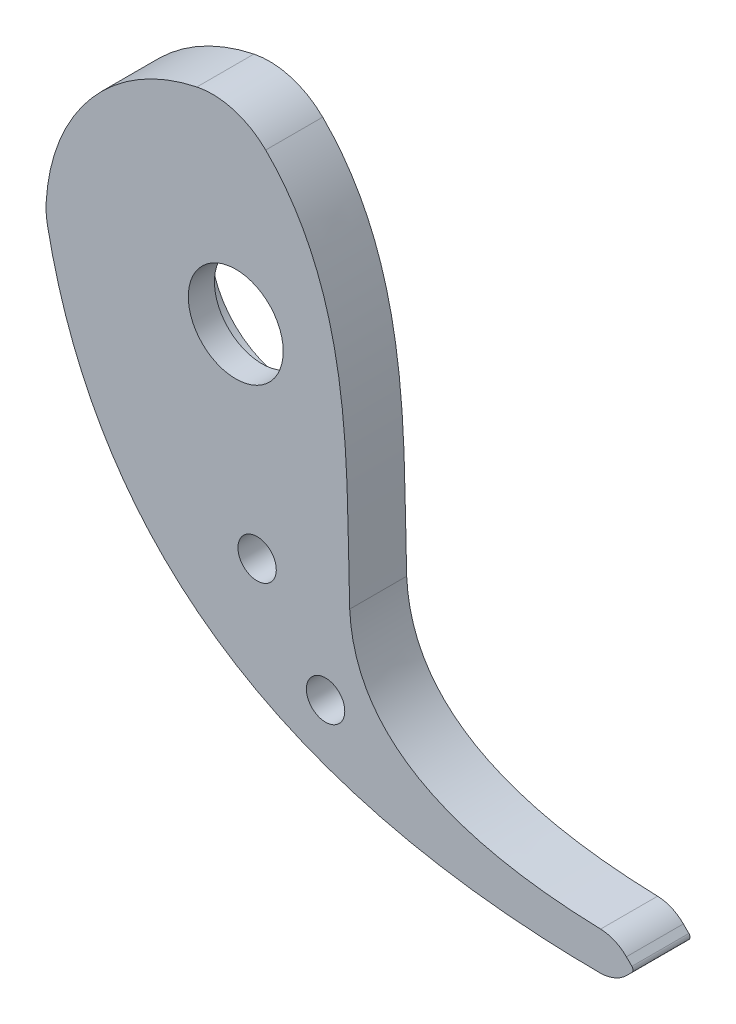
ISO-10303-21;
HEADER;
FILE_DESCRIPTION(('STEP AP214'),'2;1');
FILE_NAME('part.step','',(''),(''),'','','');
FILE_SCHEMA(('AUTOMOTIVE_DESIGN { 1 0 10303 214 1 1 1 1 }'));
ENDSEC;
DATA;
#1=APPLICATION_CONTEXT('core data for automotive mechanical design processes');
#2=APPLICATION_PROTOCOL_DEFINITION('international standard','automotive_design',2000,#1);
#3=PRODUCT_CONTEXT('',#1,'mechanical');
#4=PRODUCT('Part','Part','',(#3));
#5=PRODUCT_RELATED_PRODUCT_CATEGORY('part','',(#4));
#6=PRODUCT_DEFINITION_FORMATION('','',#4);
#7=PRODUCT_DEFINITION_CONTEXT('part definition',#1,'design');
#8=PRODUCT_DEFINITION('design','',#6,#7);
#9=PRODUCT_DEFINITION_SHAPE('','',#8);
#10=(LENGTH_UNIT() NAMED_UNIT(*) SI_UNIT(.MILLI.,.METRE.));
#11=(NAMED_UNIT(*) PLANE_ANGLE_UNIT() SI_UNIT($,.RADIAN.));
#12=(NAMED_UNIT(*) SI_UNIT($,.STERADIAN.) SOLID_ANGLE_UNIT());
#13=UNCERTAINTY_MEASURE_WITH_UNIT(LENGTH_MEASURE(1.E-05),#10,'distance_accuracy_value','');
#14=(GEOMETRIC_REPRESENTATION_CONTEXT(3) GLOBAL_UNCERTAINTY_ASSIGNED_CONTEXT((#13)) GLOBAL_UNIT_ASSIGNED_CONTEXT((#10,
#11,#12)) REPRESENTATION_CONTEXT('',''));
#15=CARTESIAN_POINT('',(0.,0.,0.));
#16=DIRECTION('',(0.,0.,1.));
#17=DIRECTION('',(1.,0.,0.));
#18=AXIS2_PLACEMENT_3D('',#15,#16,#17);
#19=CARTESIAN_POINT('',(0.,0.,84.));
#20=DIRECTION('',(0.,0.,1.));
#21=DIRECTION('',(1.,0.,0.));
#22=AXIS2_PLACEMENT_3D('',#19,#20,#21);
#23=CYLINDRICAL_SURFACE('',#22,12.5);
#24=CARTESIAN_POINT('',(0.,0.,93.12));
#25=DIRECTION('',(0.,0.,1.));
#26=DIRECTION('',(1.,0.,0.));
#27=AXIS2_PLACEMENT_3D('',#24,#25,#26);
#28=CIRCLE('',#27,12.5);
#29=CARTESIAN_POINT('',(12.5,0.,93.12));
#30=VERTEX_POINT('',#29);
#31=EDGE_CURVE('E38',#30,#30,#28,.F.);
#32=ORIENTED_EDGE('',*,*,#31,.T.);
#33=EDGE_LOOP('',(#32));
#34=FACE_BOUND('',#33,.T.);
#35=CARTESIAN_POINT('',(0.,0.,100.));
#36=DIRECTION('',(0.,0.,1.));
#37=DIRECTION('',(1.,0.,0.));
#38=AXIS2_PLACEMENT_3D('',#35,#36,#37);
#39=CIRCLE('',#38,12.5);
#40=CARTESIAN_POINT('',(12.5,0.,100.));
#41=VERTEX_POINT('',#40);
#42=EDGE_CURVE('E181',#41,#41,#39,.T.);
#43=ORIENTED_EDGE('',*,*,#42,.T.);
#44=EDGE_LOOP('',(#43));
#45=FACE_BOUND('',#44,.T.);
#46=ADVANCED_FACE('F33',(#34,#45),#23,.F.);
#47=CARTESIAN_POINT('',(96.0614321255408,-89.9222344491999,100.));
#48=CARTESIAN_POINT('',(74.6396324890567,-89.3105921557209,100.));
#49=CARTESIAN_POINT('',(42.207594165123,-82.0452441207387,100.));
#50=CARTESIAN_POINT('',(30.5986777387312,-62.6957691895991,100.));
#51=CARTESIAN_POINT('',(30.,-50.,100.));
#52=B_SPLINE_CURVE_WITH_KNOTS('',3,(#47,#48,#49,#50,#51),.UNSPECIFIED.,.F.,.F.,(4,1,4),
(0.0277647284146162,0.487449893921152,0.947135059427687),.UNSPECIFIED.);
#53=DIRECTION('',(0.,0.,-1.));
#54=VECTOR('',#53,1.);
#55=SURFACE_OF_LINEAR_EXTRUSION('',#52,#54);
#56=DIRECTION('',(0.,0.,-1.));
#57=VECTOR('',#56,1.);
#58=CARTESIAN_POINT('',(96.0614321255408,-89.9222344491999,100.));
#59=LINE('',#58,#57);
#60=CARTESIAN_POINT('',(96.0614321255408,-89.9222344491999,100.));
#61=VERTEX_POINT('',#60);
#62=CARTESIAN_POINT('',(96.0614321255408,-89.9222344491999,85.));
#63=VERTEX_POINT('',#62);
#64=EDGE_CURVE('E138',#61,#63,#59,.T.);
#65=ORIENTED_EDGE('',*,*,#64,.T.);
#66=CARTESIAN_POINT('',(96.0614321255408,-89.9222344491999,85.));
#67=CARTESIAN_POINT('',(74.6396324890567,-89.3105921557209,85.));
#68=CARTESIAN_POINT('',(42.207594165123,-82.0452441207387,85.));
#69=CARTESIAN_POINT('',(30.5986777387312,-62.6957691895991,85.));
#70=CARTESIAN_POINT('',(30.,-50.,85.));
#71=B_SPLINE_CURVE_WITH_KNOTS('',3,(#66,#67,#68,#69,#70),.UNSPECIFIED.,.F.,.F.,(4,1,4),
(0.0277647284146162,0.487449893921152,0.947135059427687),.UNSPECIFIED.);
#72=CARTESIAN_POINT('',(30.,-50.,85.));
#73=VERTEX_POINT('',#72);
#74=EDGE_CURVE('E51',#63,#73,#71,.T.);
#75=ORIENTED_EDGE('',*,*,#74,.T.);
#76=DIRECTION('',(0.,0.,-1.));
#77=VECTOR('',#76,1.);
#78=CARTESIAN_POINT('',(30.,-50.,100.));
#79=LINE('',#78,#77);
#80=CARTESIAN_POINT('',(30.,-50.,100.));
#81=VERTEX_POINT('',#80);
#82=EDGE_CURVE('E11',#81,#73,#79,.T.);
#83=ORIENTED_EDGE('',*,*,#82,.F.);
#84=EDGE_CURVE('E234',#61,#81,#52,.T.);
#85=ORIENTED_EDGE('',*,*,#84,.F.);
#86=EDGE_LOOP('',(#65,#75,#83,#85));
#87=FACE_BOUND('',#86,.T.);
#88=ADVANCED_FACE('F35',(#87),#55,.F.);
#89=CARTESIAN_POINT('',(30.,-50.,100.));
#90=CARTESIAN_POINT('',(29.0655778584205,-23.9165926404982,100.));
#91=CARTESIAN_POINT('',(31.4518831291268,15.3536689120195,100.));
#92=CARTESIAN_POINT('',(10.553539900454,41.0011969030345,100.));
#93=CARTESIAN_POINT('',(7.88775097032687,43.6234763854406,100.));
#94=B_SPLINE_CURVE_WITH_KNOTS('',3,(#89,#90,#91,#92,#93),.UNSPECIFIED.,.F.,.F.,(4,1,4),(0.,
0.805376888640356,0.908560602925233),.UNSPECIFIED.);
#95=DIRECTION('',(0.,0.,-1.));
#96=VECTOR('',#95,1.);
#97=SURFACE_OF_LINEAR_EXTRUSION('',#94,#96);
#98=ORIENTED_EDGE('',*,*,#82,.T.);
#99=CARTESIAN_POINT('',(30.,-50.,85.));
#100=CARTESIAN_POINT('',(29.0655778584205,-23.9165926404982,85.));
#101=CARTESIAN_POINT('',(31.4518831291268,15.3536689120195,85.));
#102=CARTESIAN_POINT('',(10.553539900454,41.0011969030345,85.));
#103=CARTESIAN_POINT('',(7.88775097032687,43.6234763854406,85.));
#104=B_SPLINE_CURVE_WITH_KNOTS('',3,(#99,#100,#101,#102,#103),.UNSPECIFIED.,.F.,.F.,(4,1,4),(0.,
0.805376888640356,0.908560602925233),.UNSPECIFIED.);
#105=CARTESIAN_POINT('',(7.88775097032688,43.6234763854406,85.));
#106=VERTEX_POINT('',#105);
#107=EDGE_CURVE('E224',#73,#106,#104,.T.);
#108=ORIENTED_EDGE('',*,*,#107,.T.);
#109=DIRECTION('',(0.,0.,-1.));
#110=VECTOR('',#109,1.);
#111=CARTESIAN_POINT('',(7.88775097032687,43.6234763854406,100.));
#112=LINE('',#111,#110);
#113=CARTESIAN_POINT('',(7.88775097032687,43.6234763854406,100.));
#114=VERTEX_POINT('',#113);
#115=EDGE_CURVE('E43',#114,#106,#112,.T.);
#116=ORIENTED_EDGE('',*,*,#115,.F.);
#117=EDGE_CURVE('E242',#81,#114,#94,.T.);
#118=ORIENTED_EDGE('',*,*,#117,.F.);
#119=EDGE_LOOP('',(#98,#108,#116,#118));
#120=FACE_BOUND('',#119,.T.);
#121=ADVANCED_FACE('F255',(#120),#97,.F.);
#122=CARTESIAN_POINT('',(-6.13755051397834,29.3654639617419,100.));
#123=DIRECTION('',(0.,0.,-1.));
#124=DIRECTION('',(-1.,0.,0.));
#125=AXIS2_PLACEMENT_3D('',#122,#123,#124);
#126=CYLINDRICAL_SURFACE('',#125,20.);
#127=ORIENTED_EDGE('',*,*,#115,.T.);
#128=CARTESIAN_POINT('',(-6.13755051397834,29.3654639617419,85.));
#129=DIRECTION('',(0.,0.,1.));
#130=DIRECTION('',(1.,0.,0.));
#131=AXIS2_PLACEMENT_3D('',#128,#129,#130);
#132=CIRCLE('',#131,20.);
#133=CARTESIAN_POINT('',(-10.2292508566306,48.9424399362366,85.));
#134=VERTEX_POINT('',#133);
#135=EDGE_CURVE('E221',#106,#134,#132,.T.);
#136=ORIENTED_EDGE('',*,*,#135,.T.);
#137=DIRECTION('',(0.,0.,-1.));
#138=VECTOR('',#137,1.);
#139=CARTESIAN_POINT('',(-10.2292508566306,48.9424399362366,100.));
#140=LINE('',#139,#138);
#141=CARTESIAN_POINT('',(-10.2292508566306,48.9424399362366,100.));
#142=VERTEX_POINT('',#141);
#143=EDGE_CURVE('E159',#142,#134,#140,.T.);
#144=ORIENTED_EDGE('',*,*,#143,.F.);
#145=CARTESIAN_POINT('',(-6.13755051397834,29.3654639617419,100.));
#146=DIRECTION('',(0.,0.,1.));
#147=DIRECTION('',(1.,0.,0.));
#148=AXIS2_PLACEMENT_3D('',#145,#146,#147);
#149=CIRCLE('',#148,20.);
#150=EDGE_CURVE('E250',#114,#142,#149,.T.);
#151=ORIENTED_EDGE('',*,*,#150,.F.);
#152=EDGE_LOOP('',(#127,#136,#144,#151));
#153=FACE_BOUND('',#152,.T.);
#154=ADVANCED_FACE('F258',(#153),#126,.T.);
#155=CARTESIAN_POINT('',(0.,0.,100.));
#156=DIRECTION('',(0.,0.,-1.));
#157=DIRECTION('',(-1.,0.,0.));
#158=AXIS2_PLACEMENT_3D('',#155,#156,#157);
#159=CYLINDRICAL_SURFACE('',#158,50.);
#160=ORIENTED_EDGE('',*,*,#143,.T.);
#161=CARTESIAN_POINT('',(0.,0.,85.));
#162=DIRECTION('',(0.,0.,1.));
#163=DIRECTION('',(1.,0.,0.));
#164=AXIS2_PLACEMENT_3D('',#161,#162,#163);
#165=CIRCLE('',#164,50.);
#166=CARTESIAN_POINT('',(-49.9267220496655,2.70599803685169,85.));
#167=VERTEX_POINT('',#166);
#168=EDGE_CURVE('E218',#134,#167,#165,.T.);
#169=ORIENTED_EDGE('',*,*,#168,.T.);
#170=DIRECTION('',(0.,0.,-1.));
#171=VECTOR('',#170,1.);
#172=CARTESIAN_POINT('',(-49.9267220496655,2.70599803685169,100.));
#173=LINE('',#172,#171);
#174=CARTESIAN_POINT('',(-49.9267220496655,2.70599803685169,100.));
#175=VERTEX_POINT('',#174);
#176=EDGE_CURVE('E156',#175,#167,#173,.T.);
#177=ORIENTED_EDGE('',*,*,#176,.F.);
#178=CARTESIAN_POINT('',(0.,0.,100.));
#179=DIRECTION('',(0.,0.,1.));
#180=DIRECTION('',(1.,0.,0.));
#181=AXIS2_PLACEMENT_3D('',#178,#179,#180);
#182=CIRCLE('',#181,50.);
#183=EDGE_CURVE('E314',#142,#175,#182,.T.);
#184=ORIENTED_EDGE('',*,*,#183,.F.);
#185=EDGE_LOOP('',(#160,#169,#177,#184));
#186=FACE_BOUND('',#185,.T.);
#187=ADVANCED_FACE('F262',(#186),#159,.T.);
#188=CARTESIAN_POINT('',(-29.9560332297993,1.62359882211103,100.));
#189=DIRECTION('',(0.,0.,-1.));
#190=DIRECTION('',(-1.,0.,0.));
#191=AXIS2_PLACEMENT_3D('',#188,#189,#190);
#192=CYLINDRICAL_SURFACE('',#191,20.);
#193=ORIENTED_EDGE('',*,*,#176,.T.);
#194=CARTESIAN_POINT('',(-29.9560332297993,1.62359882211103,85.));
#195=DIRECTION('',(0.,0.,1.));
#196=DIRECTION('',(1.,0.,0.));
#197=AXIS2_PLACEMENT_3D('',#194,#195,#196);
#198=CIRCLE('',#197,20.);
#199=CARTESIAN_POINT('',(-49.5860072797543,-2.20577694922467,85.));
#200=VERTEX_POINT('',#199);
#201=EDGE_CURVE('E212',#167,#200,#198,.T.);
#202=ORIENTED_EDGE('',*,*,#201,.T.);
#203=DIRECTION('',(0.,0.,-1.));
#204=VECTOR('',#203,1.);
#205=CARTESIAN_POINT('',(-49.5860072797543,-2.20577694922468,100.));
#206=LINE('',#205,#204);
#207=CARTESIAN_POINT('',(-49.5860072797543,-2.20577694922468,100.));
#208=VERTEX_POINT('',#207);
#209=EDGE_CURVE('E153',#208,#200,#206,.T.);
#210=ORIENTED_EDGE('',*,*,#209,.F.);
#211=CARTESIAN_POINT('',(-29.9560332297993,1.62359882211103,100.));
#212=DIRECTION('',(0.,0.,1.));
#213=DIRECTION('',(-1.,0.,0.));
#214=AXIS2_PLACEMENT_3D('',#211,#212,#213);
#215=CIRCLE('',#214,20.);
#216=EDGE_CURVE('E285',#175,#208,#215,.T.);
#217=ORIENTED_EDGE('',*,*,#216,.F.);
#218=EDGE_LOOP('',(#193,#202,#210,#217));
#219=FACE_BOUND('',#218,.T.);
#220=ADVANCED_FACE('F266',(#219),#192,.T.);
#221=CARTESIAN_POINT('',(-49.5860072797543,-2.20577694922467,100.));
#222=CARTESIAN_POINT('',(-47.0447095065424,-15.2328634302042,100.));
#223=CARTESIAN_POINT('',(-27.0452536153668,-73.5633104074933,100.));
#224=CARTESIAN_POINT('',(28.6366700505365,-99.6569197690937,100.));
#225=CARTESIAN_POINT('',(95.8012423090635,-100.004707302185,100.));
#226=B_SPLINE_CURVE_WITH_KNOTS('',3,(#221,#222,#223,#224,#225),.UNSPECIFIED.,.F.,.F.,(4,1,4),
(0.0110398117893649,0.207725041354784,0.983937689400536),.UNSPECIFIED.);
#227=DIRECTION('',(0.,0.,-1.));
#228=VECTOR('',#227,1.);
#229=SURFACE_OF_LINEAR_EXTRUSION('',#226,#228);
#230=ORIENTED_EDGE('',*,*,#209,.T.);
#231=CARTESIAN_POINT('',(-49.5860072797543,-2.20577694922467,85.));
#232=CARTESIAN_POINT('',(-47.0447095065424,-15.2328634302042,85.));
#233=CARTESIAN_POINT('',(-27.0452536153668,-73.5633104074933,85.));
#234=CARTESIAN_POINT('',(28.6366700505365,-99.6569197690937,85.));
#235=CARTESIAN_POINT('',(95.8012423090635,-100.004707302185,85.));
#236=B_SPLINE_CURVE_WITH_KNOTS('',3,(#231,#232,#233,#234,#235),.UNSPECIFIED.,.F.,.F.,(4,1,4),
(0.0110398117893649,0.207725041354784,0.983937689400536),.UNSPECIFIED.);
#237=CARTESIAN_POINT('',(95.8012423090635,-100.004707302185,85.));
#238=VERTEX_POINT('',#237);
#239=EDGE_CURVE('E207',#200,#238,#236,.T.);
#240=ORIENTED_EDGE('',*,*,#239,.T.);
#241=DIRECTION('',(0.,0.,-1.));
#242=VECTOR('',#241,1.);
#243=CARTESIAN_POINT('',(95.8012423090635,-100.004707302185,100.));
#244=LINE('',#243,#242);
#245=CARTESIAN_POINT('',(95.8012423090635,-100.004707302185,100.));
#246=VERTEX_POINT('',#245);
#247=EDGE_CURVE('E150',#246,#238,#244,.T.);
#248=ORIENTED_EDGE('',*,*,#247,.F.);
#249=EDGE_CURVE('E278',#208,#246,#226,.T.);
#250=ORIENTED_EDGE('',*,*,#249,.F.);
#251=EDGE_LOOP('',(#230,#240,#248,#250));
#252=FACE_BOUND('',#251,.T.);
#253=ADVANCED_FACE('F270',(#252),#229,.F.);
#254=CARTESIAN_POINT('',(95.8530230111228,-90.0048413651389,100.));
#255=DIRECTION('',(0.,0.,-1.));
#256=DIRECTION('',(-1.,0.,0.));
#257=AXIS2_PLACEMENT_3D('',#254,#255,#256);
#258=CYLINDRICAL_SURFACE('',#257,10.);
#259=ORIENTED_EDGE('',*,*,#247,.T.);
#260=CARTESIAN_POINT('',(95.8530230111228,-90.0048413651389,85.));
#261=DIRECTION('',(0.,0.,1.));
#262=DIRECTION('',(1.,0.,0.));
#263=AXIS2_PLACEMENT_3D('',#260,#261,#262);
#264=CIRCLE('',#263,10.);
#265=CARTESIAN_POINT('',(102.924090822988,-97.0759091770044,85.));
#266=VERTEX_POINT('',#265);
#267=EDGE_CURVE('E204',#238,#266,#264,.T.);
#268=ORIENTED_EDGE('',*,*,#267,.T.);
#269=DIRECTION('',(0.,0.,-1.));
#270=VECTOR('',#269,1.);
#271=CARTESIAN_POINT('',(102.924090822988,-97.0759091770044,100.));
#272=LINE('',#271,#270);
#273=CARTESIAN_POINT('',(102.924090822988,-97.0759091770044,100.));
#274=VERTEX_POINT('',#273);
#275=EDGE_CURVE('E147',#274,#266,#272,.T.);
#276=ORIENTED_EDGE('',*,*,#275,.F.);
#277=CARTESIAN_POINT('',(95.8530230111228,-90.0048413651389,100.));
#278=DIRECTION('',(0.,0.,1.));
#279=DIRECTION('',(-1.,0.,0.));
#280=AXIS2_PLACEMENT_3D('',#277,#278,#279);
#281=CIRCLE('',#280,10.);
#282=EDGE_CURVE('E284',#246,#274,#281,.T.);
#283=ORIENTED_EDGE('',*,*,#282,.F.);
#284=EDGE_LOOP('',(#259,#268,#276,#283));
#285=FACE_BOUND('',#284,.T.);
#286=ADVANCED_FACE('F275',(#285),#258,.T.);
#287=CARTESIAN_POINT('',(102.924090822988,-97.0759091770044,100.));
#288=DIRECTION('',(-0.707106781186551,0.707106781186544,0.));
#289=DIRECTION('',(-0.707106781186544,-0.707106781186551,0.));
#290=AXIS2_PLACEMENT_3D('',#287,#288,#289);
#291=PLANE('',#290);
#292=ORIENTED_EDGE('',*,*,#275,.T.);
#293=DIRECTION('',(0.707106781186544,0.707106781186551,0.));
#294=VECTOR('',#293,1.);
#295=CARTESIAN_POINT('',(102.924090822988,-97.0759091770044,85.));
#296=LINE('',#295,#294);
#297=CARTESIAN_POINT('',(104.29289321881,-95.7071067811829,85.));
#298=VERTEX_POINT('',#297);
#299=EDGE_CURVE('E201',#266,#298,#296,.T.);
#300=ORIENTED_EDGE('',*,*,#299,.T.);
#301=DIRECTION('',(0.,0.,-1.));
#302=VECTOR('',#301,1.);
#303=CARTESIAN_POINT('',(104.29289321881,-95.7071067811829,100.));
#304=LINE('',#303,#302);
#305=CARTESIAN_POINT('',(104.29289321881,-95.7071067811829,100.));
#306=VERTEX_POINT('',#305);
#307=EDGE_CURVE('E140',#306,#298,#304,.T.);
#308=ORIENTED_EDGE('',*,*,#307,.F.);
#309=DIRECTION('',(0.707106781186544,0.707106781186551,0.));
#310=VECTOR('',#309,1.);
#311=CARTESIAN_POINT('',(102.924090822988,-97.0759091770044,100.));
#312=LINE('',#311,#310);
#313=EDGE_CURVE('E290',#274,#306,#312,.T.);
#314=ORIENTED_EDGE('',*,*,#313,.F.);
#315=EDGE_LOOP('',(#292,#300,#308,#314));
#316=FACE_BOUND('',#315,.T.);
#317=ADVANCED_FACE('F303',(#316),#291,.F.);
#318=CARTESIAN_POINT('',(103.585786437623,-94.9999999999963,100.));
#319=DIRECTION('',(0.,0.,-1.));
#320=DIRECTION('',(-1.,0.,0.));
#321=AXIS2_PLACEMENT_3D('',#318,#319,#320);
#322=CYLINDRICAL_SURFACE('',#321,0.999999999999997);
#323=ORIENTED_EDGE('',*,*,#307,.T.);
#324=CARTESIAN_POINT('',(103.585786437623,-94.9999999999963,85.));
#325=DIRECTION('',(0.,0.,1.));
#326=DIRECTION('',(1.,0.,0.));
#327=AXIS2_PLACEMENT_3D('',#324,#325,#326);
#328=CIRCLE('',#327,0.999999999999997);
#329=CARTESIAN_POINT('',(104.29289321881,-94.2928932188098,85.));
#330=VERTEX_POINT('',#329);
#331=EDGE_CURVE('E135',#298,#330,#328,.T.);
#332=ORIENTED_EDGE('',*,*,#331,.T.);
#333=DIRECTION('',(0.,0.,-1.));
#334=VECTOR('',#333,1.);
#335=CARTESIAN_POINT('',(104.29289321881,-94.2928932188098,100.));
#336=LINE('',#335,#334);
#337=CARTESIAN_POINT('',(104.29289321881,-94.2928932188098,100.));
#338=VERTEX_POINT('',#337);
#339=EDGE_CURVE('E134',#338,#330,#336,.T.);
#340=ORIENTED_EDGE('',*,*,#339,.F.);
#341=CARTESIAN_POINT('',(103.585786437623,-94.9999999999963,100.));
#342=DIRECTION('',(0.,0.,1.));
#343=DIRECTION('',(-1.,0.,0.));
#344=AXIS2_PLACEMENT_3D('',#341,#342,#343);
#345=CIRCLE('',#344,0.999999999999997);
#346=EDGE_CURVE('E292',#306,#338,#345,.T.);
#347=ORIENTED_EDGE('',*,*,#346,.F.);
#348=EDGE_LOOP('',(#323,#332,#340,#347));
#349=FACE_BOUND('',#348,.T.);
#350=ADVANCED_FACE('F301',(#349),#322,.T.);
#351=CARTESIAN_POINT('',(102.84709295017,-92.8470929501699,100.));
#352=DIRECTION('',(-0.707106781186548,-0.707106781186548,0.));
#353=DIRECTION('',(0.707106781186548,-0.707106781186548,0.));
#354=AXIS2_PLACEMENT_3D('',#351,#352,#353);
#355=PLANE('',#354);
#356=ORIENTED_EDGE('',*,*,#339,.T.);
#357=DIRECTION('',(-0.707106781186548,0.707106781186548,0.));
#358=VECTOR('',#357,1.);
#359=CARTESIAN_POINT('',(102.84709295017,-92.8470929501699,85.));
#360=LINE('',#359,#358);
#361=CARTESIAN_POINT('',(102.84709295017,-92.8470929501699,85.));
#362=VERTEX_POINT('',#361);
#363=EDGE_CURVE('E120',#330,#362,#360,.T.);
#364=ORIENTED_EDGE('',*,*,#363,.T.);
#365=DIRECTION('',(0.,0.,-1.));
#366=VECTOR('',#365,1.);
#367=CARTESIAN_POINT('',(102.84709295017,-92.8470929501699,100.));
#368=LINE('',#367,#366);
#369=CARTESIAN_POINT('',(102.84709295017,-92.8470929501699,100.));
#370=VERTEX_POINT('',#369);
#371=EDGE_CURVE('E132',#370,#362,#368,.T.);
#372=ORIENTED_EDGE('',*,*,#371,.F.);
#373=DIRECTION('',(-0.707106781186548,0.707106781186548,0.));
#374=VECTOR('',#373,1.);
#375=CARTESIAN_POINT('',(102.84709295017,-92.8470929501699,100.));
#376=LINE('',#375,#374);
#377=EDGE_CURVE('E294',#338,#370,#376,.T.);
#378=ORIENTED_EDGE('',*,*,#377,.F.);
#379=EDGE_LOOP('',(#356,#364,#372,#378));
#380=FACE_BOUND('',#379,.T.);
#381=ADVANCED_FACE('F130',(#380),#355,.F.);
#382=CARTESIAN_POINT('',(95.7760251383045,-99.9181607620354,100.));
#383=DIRECTION('',(0.,0.,-1.));
#384=DIRECTION('',(-1.,0.,0.));
#385=AXIS2_PLACEMENT_3D('',#382,#383,#384);
#386=CYLINDRICAL_SURFACE('',#385,10.);
#387=ORIENTED_EDGE('',*,*,#371,.T.);
#388=CARTESIAN_POINT('',(95.7760251383045,-99.9181607620354,85.));
#389=DIRECTION('',(0.,0.,1.));
#390=DIRECTION('',(1.,0.,0.));
#391=AXIS2_PLACEMENT_3D('',#388,#389,#390);
#392=CIRCLE('',#391,10.);
#393=EDGE_CURVE('E117',#362,#63,#392,.T.);
#394=ORIENTED_EDGE('',*,*,#393,.T.);
#395=ORIENTED_EDGE('',*,*,#64,.F.);
#396=CARTESIAN_POINT('',(95.7760251383045,-99.9181607620354,100.));
#397=DIRECTION('',(0.,0.,1.));
#398=DIRECTION('',(1.,0.,0.));
#399=AXIS2_PLACEMENT_3D('',#396,#397,#398);
#400=CIRCLE('',#399,10.);
#401=EDGE_CURVE('E59',#370,#61,#400,.T.);
#402=ORIENTED_EDGE('',*,*,#401,.F.);
#403=EDGE_LOOP('',(#387,#394,#395,#402));
#404=FACE_BOUND('',#403,.T.);
#405=ADVANCED_FACE('F137',(#404),#386,.T.);
#406=CARTESIAN_POINT('',(47.4133746395084,-79.0242123966994,100.));
#407=DIRECTION('',(0.,0.,1.));
#408=DIRECTION('',(1.,0.,0.));
#409=AXIS2_PLACEMENT_3D('',#406,#407,#408);
#410=PLANE('',#409);
#411=CARTESIAN_POINT('',(23.6513180824392,-73.9138117802537,100.));
#412=DIRECTION('',(0.,0.,1.));
#413=DIRECTION('',(1.,0.,0.));
#414=AXIS2_PLACEMENT_3D('',#411,#412,#413);
#415=CIRCLE('',#414,5.05);
#416=CARTESIAN_POINT('',(28.7013180824392,-73.9138117802537,100.));
#417=VERTEX_POINT('',#416);
#418=EDGE_CURVE('E125',#417,#417,#415,.F.);
#419=ORIENTED_EDGE('',*,*,#418,.T.);
#420=EDGE_LOOP('',(#419));
#421=FACE_BOUND('',#420,.T.);
#422=CARTESIAN_POINT('',(5.62196341020624,-50.7014980743151,100.));
#423=DIRECTION('',(0.,0.,1.));
#424=DIRECTION('',(1.,0.,0.));
#425=AXIS2_PLACEMENT_3D('',#422,#423,#424);
#426=CIRCLE('',#425,5.05);
#427=CARTESIAN_POINT('',(10.6666689251155,-50.932682563078,100.));
#428=VERTEX_POINT('',#427);
#429=EDGE_CURVE('E171',#428,#428,#426,.F.);
#430=ORIENTED_EDGE('',*,*,#429,.T.);
#431=EDGE_LOOP('',(#430));
#432=FACE_BOUND('',#431,.T.);
#433=ORIENTED_EDGE('',*,*,#84,.T.);
#434=ORIENTED_EDGE('',*,*,#117,.T.);
#435=ORIENTED_EDGE('',*,*,#150,.T.);
#436=ORIENTED_EDGE('',*,*,#183,.T.);
#437=ORIENTED_EDGE('',*,*,#216,.T.);
#438=ORIENTED_EDGE('',*,*,#249,.T.);
#439=ORIENTED_EDGE('',*,*,#282,.T.);
#440=ORIENTED_EDGE('',*,*,#313,.T.);
#441=ORIENTED_EDGE('',*,*,#346,.T.);
#442=ORIENTED_EDGE('',*,*,#377,.T.);
#443=ORIENTED_EDGE('',*,*,#401,.T.);
#444=EDGE_LOOP('',(#433,#434,#435,#436,#437,#438,#439,#440,#441,#442,#443));
#445=FACE_BOUND('',#444,.T.);
#446=ORIENTED_EDGE('',*,*,#42,.F.);
#447=EDGE_LOOP('',(#446));
#448=FACE_BOUND('',#447,.T.);
#449=ADVANCED_FACE('F295',(#421,#432,#445,#448),#410,.T.);
#450=CARTESIAN_POINT('',(0.,0.,85.));
#451=DIRECTION('',(0.,0.,1.));
#452=DIRECTION('',(1.,0.,0.));
#453=AXIS2_PLACEMENT_3D('',#450,#451,#452);
#454=PLANE('',#453);
#455=CARTESIAN_POINT('',(0.,0.,85.));
#456=DIRECTION('',(0.,0.,1.));
#457=DIRECTION('',(1.,0.,0.));
#458=AXIS2_PLACEMENT_3D('',#455,#456,#457);
#459=CIRCLE('',#458,21.63);
#460=CARTESIAN_POINT('',(21.63,0.,85.));
#461=VERTEX_POINT('',#460);
#462=EDGE_CURVE('E175',#461,#461,#459,.F.);
#463=ORIENTED_EDGE('',*,*,#462,.F.);
#464=EDGE_LOOP('',(#463));
#465=FACE_BOUND('',#464,.T.);
#466=CARTESIAN_POINT('',(23.6513180824392,-73.9138117802537,85.));
#467=DIRECTION('',(0.,0.,1.));
#468=DIRECTION('',(1.,0.,0.));
#469=AXIS2_PLACEMENT_3D('',#466,#467,#468);
#470=CIRCLE('',#469,3.03);
#471=CARTESIAN_POINT('',(26.6813180824392,-73.9138117802537,85.));
#472=VERTEX_POINT('',#471);
#473=EDGE_CURVE('E167',#472,#472,#470,.F.);
#474=ORIENTED_EDGE('',*,*,#473,.F.);
#475=EDGE_LOOP('',(#474));
#476=FACE_BOUND('',#475,.T.);
#477=CARTESIAN_POINT('',(5.62196341020624,-50.7014980743151,85.));
#478=DIRECTION('',(0.,0.,1.));
#479=DIRECTION('',(1.,0.,0.));
#480=AXIS2_PLACEMENT_3D('',#477,#478,#479);
#481=CIRCLE('',#480,3.03);
#482=CARTESIAN_POINT('',(8.64878671915177,-50.8402087675728,85.));
#483=VERTEX_POINT('',#482);
#484=EDGE_CURVE('E164',#483,#483,#481,.F.);
#485=ORIENTED_EDGE('',*,*,#484,.F.);
#486=EDGE_LOOP('',(#485));
#487=FACE_BOUND('',#486,.T.);
#488=ORIENTED_EDGE('',*,*,#393,.F.);
#489=ORIENTED_EDGE('',*,*,#363,.F.);
#490=ORIENTED_EDGE('',*,*,#331,.F.);
#491=ORIENTED_EDGE('',*,*,#299,.F.);
#492=ORIENTED_EDGE('',*,*,#267,.F.);
#493=ORIENTED_EDGE('',*,*,#239,.F.);
#494=ORIENTED_EDGE('',*,*,#201,.F.);
#495=ORIENTED_EDGE('',*,*,#168,.F.);
#496=ORIENTED_EDGE('',*,*,#135,.F.);
#497=ORIENTED_EDGE('',*,*,#107,.F.);
#498=ORIENTED_EDGE('',*,*,#74,.F.);
#499=EDGE_LOOP('',(#488,#489,#490,#491,#492,#493,#494,#495,#496,#497,#498));
#500=FACE_BOUND('',#499,.T.);
#501=ADVANCED_FACE('F119',(#465,#476,#487,#500),#454,.F.);
#502=CARTESIAN_POINT('',(5.62196341020624,-50.7014980743151,14.6340844617728));
#503=DIRECTION('',(0.,0.,1.));
#504=DIRECTION('',(0.998951587110736,-0.04577910668572,0.));
#505=AXIS2_PLACEMENT_3D('',#502,#503,#504);
#506=CYLINDRICAL_SURFACE('',#505,3.03);
#507=CARTESIAN_POINT('',(5.62196341020624,-50.7014980743151,90.3840844617728));
#508=DIRECTION('',(0.,0.,-1.));
#509=DIRECTION('',(-0.998951587110736,0.04577910668572,0.));
#510=AXIS2_PLACEMENT_3D('',#507,#508,#509);
#511=CIRCLE('',#510,3.03);
#512=CARTESIAN_POINT('',(8.64878671915177,-50.8402087675728,90.3840844617727));
#513=VERTEX_POINT('',#512);
#514=EDGE_CURVE('E195',#513,#513,#511,.T.);
#515=CARTESIAN_POINT('',(8.64878671915177,-50.8402087675728,90.3840844617727));
#516=CARTESIAN_POINT('',(8.64878671915177,-50.8402087675728,90.3280002486293));
#517=CARTESIAN_POINT('',(8.64878671915177,-50.8402087675728,90.2719160354858));
#518=CARTESIAN_POINT('',(8.64878671915177,-50.8402087675728,90.1597476091989));
#519=CARTESIAN_POINT('',(8.64878671915177,-50.8402087675728,90.1036633960554));
#520=CARTESIAN_POINT('',(8.64878671915177,-50.8402087675728,89.9914949697685));
#521=CARTESIAN_POINT('',(8.64878671915177,-50.8402087675728,89.935410756625));
#522=CARTESIAN_POINT('',(8.64878671915177,-50.8402087675728,89.8232423303381));
#523=CARTESIAN_POINT('',(8.64878671915177,-50.8402087675728,89.7671581171946));
#524=CARTESIAN_POINT('',(8.64878671915177,-50.8402087675728,89.6549896909077));
#525=CARTESIAN_POINT('',(8.64878671915177,-50.8402087675728,89.5989054777642));
#526=CARTESIAN_POINT('',(8.64878671915177,-50.8402087675728,89.4867370514773));
#527=CARTESIAN_POINT('',(8.64878671915177,-50.8402087675728,89.4306528383338));
#528=CARTESIAN_POINT('',(8.64878671915177,-50.8402087675728,89.3184844120469));
#529=CARTESIAN_POINT('',(8.64878671915177,-50.8402087675728,89.2624001989034));
#530=CARTESIAN_POINT('',(8.64878671915177,-50.8402087675728,89.1502317726165));
#531=CARTESIAN_POINT('',(8.64878671915177,-50.8402087675728,89.094147559473));
#532=CARTESIAN_POINT('',(8.64878671915177,-50.8402087675728,88.9819791331861));
#533=CARTESIAN_POINT('',(8.64878671915177,-50.8402087675728,88.9258949200426));
#534=CARTESIAN_POINT('',(8.64878671915177,-50.8402087675728,88.8137264937557));
#535=CARTESIAN_POINT('',(8.64878671915177,-50.8402087675728,88.7576422806122));
#536=CARTESIAN_POINT('',(8.64878671915177,-50.8402087675728,88.6454738543253));
#537=CARTESIAN_POINT('',(8.64878671915177,-50.8402087675728,88.5893896411818));
#538=CARTESIAN_POINT('',(8.64878671915177,-50.8402087675728,88.4772212148949));
#539=CARTESIAN_POINT('',(8.64878671915177,-50.8402087675728,88.4211370017514));
#540=CARTESIAN_POINT('',(8.64878671915177,-50.8402087675728,88.3089685754645));
#541=CARTESIAN_POINT('',(8.64878671915177,-50.8402087675728,88.252884362321));
#542=CARTESIAN_POINT('',(8.64878671915177,-50.8402087675728,88.1407159360341));
#543=CARTESIAN_POINT('',(8.64878671915177,-50.8402087675728,88.0846317228906));
#544=CARTESIAN_POINT('',(8.64878671915177,-50.8402087675728,87.9724632966037));
#545=CARTESIAN_POINT('',(8.64878671915177,-50.8402087675728,87.9163790834602));
#546=CARTESIAN_POINT('',(8.64878671915177,-50.8402087675728,87.8042106571733));
#547=CARTESIAN_POINT('',(8.64878671915177,-50.8402087675728,87.7481264440299));
#548=CARTESIAN_POINT('',(8.64878671915177,-50.8402087675728,87.6359580177429));
#549=CARTESIAN_POINT('',(8.64878671915177,-50.8402087675728,87.5798738045994));
#550=CARTESIAN_POINT('',(8.64878671915177,-50.8402087675728,87.4677053783125));
#551=CARTESIAN_POINT('',(8.64878671915177,-50.8402087675728,87.411621165169));
#552=CARTESIAN_POINT('',(8.64878671915177,-50.8402087675728,87.2994527388821));
#553=CARTESIAN_POINT('',(8.64878671915177,-50.8402087675728,87.2433685257386));
#554=CARTESIAN_POINT('',(8.64878671915177,-50.8402087675728,87.1312000994517));
#555=CARTESIAN_POINT('',(8.64878671915177,-50.8402087675728,87.0751158863083));
#556=CARTESIAN_POINT('',(8.64878671915177,-50.8402087675728,86.9629474600213));
#557=CARTESIAN_POINT('',(8.64878671915177,-50.8402087675728,86.9068632468778));
#558=CARTESIAN_POINT('',(8.64878671915177,-50.8402087675728,86.7946948205909));
#559=CARTESIAN_POINT('',(8.64878671915177,-50.8402087675728,86.7386106074474));
#560=CARTESIAN_POINT('',(8.64878671915177,-50.8402087675728,86.6264421811605));
#561=CARTESIAN_POINT('',(8.64878671915177,-50.8402087675728,86.570357968017));
#562=CARTESIAN_POINT('',(8.64878671915177,-50.8402087675728,86.4581895417301));
#563=CARTESIAN_POINT('',(8.64878671915177,-50.8402087675728,86.4021053285867));
#564=CARTESIAN_POINT('',(8.64878671915177,-50.8402087675728,86.2899369022997));
#565=CARTESIAN_POINT('',(8.64878671915177,-50.8402087675728,86.2338526891563));
#566=CARTESIAN_POINT('',(8.64878671915177,-50.8402087675728,86.1216842628693));
#567=CARTESIAN_POINT('',(8.64878671915177,-50.8402087675728,86.0656000497259));
#568=CARTESIAN_POINT('',(8.64878671915177,-50.8402087675728,85.9534316234389));
#569=CARTESIAN_POINT('',(8.64878671915177,-50.8402087675728,85.8973474102955));
#570=CARTESIAN_POINT('',(8.64878671915177,-50.8402087675728,85.7851789840085));
#571=CARTESIAN_POINT('',(8.64878671915177,-50.8402087675728,85.7290947708651));
#572=CARTESIAN_POINT('',(8.64878671915177,-50.8402087675728,85.6169263445781));
#573=CARTESIAN_POINT('',(8.64878671915177,-50.8402087675728,85.5608421314347));
#574=CARTESIAN_POINT('',(8.64878671915177,-50.8402087675728,85.4486737051477));
#575=CARTESIAN_POINT('',(8.64878671915177,-50.8402087675728,85.3925894920043));
#576=CARTESIAN_POINT('',(8.64878671915177,-50.8402087675728,85.2804210657173));
#577=CARTESIAN_POINT('',(8.64878671915177,-50.8402087675728,85.2243368525739));
#578=CARTESIAN_POINT('',(8.64878671915177,-50.8402087675728,85.1121684262869));
#579=CARTESIAN_POINT('',(8.64878671915177,-50.8402087675728,85.0560842131435));
#580=CARTESIAN_POINT('',(8.64878671915177,-50.8402087675728,85.));
#581=B_SPLINE_CURVE_WITH_KNOTS('',3,(#515,#516,#517,#518,#519,#520,#521,#522,#523,#524,#525,
#526,#527,#528,#529,#530,#531,#532,#533,#534,#535,#536,#537,#538,#539,#540,#541,#542,#543,#544,
#545,#546,#547,#548,#549,#550,#551,#552,#553,#554,#555,#556,#557,#558,#559,#560,#561,#562,#563,
#564,#565,#566,#567,#568,#569,#570,#571,#572,#573,#574,#575,#576,#577,#578,#579,#580),
.UNSPECIFIED.,.F.,.F.,(4,2,2,2,2,2,2,2,2,2,2,2,2,2,2,2,2,2,2,2,2,2,2,2,2,2,2,2,2,2,2,2,4),(0.,
0.168252639430405,0.336505278860796,0.504757918291188,0.673010557721593,0.841263197151998,
1.00951583658239,1.17776847601278,1.34602111544319,1.51427375487359,1.68252639430398,
1.85077903373437,2.01903167316478,2.18728431259518,2.35553695202557,2.52378959145597,
2.69204223088637,2.86029487031678,3.02854750974717,3.19680014917756,3.36505278860796,
3.53330542803837,3.70155806746876,3.86981070689915,4.03806334632956,4.20631598575996,
4.37456862519035,4.54282126462074,4.71107390405115,4.87932654348155,5.04757918291195,
5.21583182234234,5.38408446177274),.UNSPECIFIED.);
#582=EDGE_CURVE('BSEAM349',#513,#483,#581,.T.);
#583=ORIENTED_EDGE('',*,*,#514,.F.);
#584=ORIENTED_EDGE('',*,*,#484,.T.);
#585=ORIENTED_EDGE('',*,*,#582,.T.);
#586=ORIENTED_EDGE('',*,*,#582,.F.);
#587=EDGE_LOOP('',(#583,#585,#584,#586));
#588=FACE_BOUND('',#587,.T.);
#589=ADVANCED_FACE('F349',(#588),#506,.F.);
#590=CARTESIAN_POINT('',(5.62196341020624,-50.7014980743151,90.3840844617728));
#591=DIRECTION('',(0.,0.,1.));
#592=DIRECTION('',(0.998951587110736,-0.04577910668572,0.));
#593=AXIS2_PLACEMENT_3D('',#590,#591,#592);
#594=CYLINDRICAL_SURFACE('',#593,5.05);
#595=CARTESIAN_POINT('',(5.62196341020624,-50.7014980743151,90.3840844617728));
#596=DIRECTION('',(0.,0.,-1.));
#597=DIRECTION('',(-0.998951587110736,0.04577910668572,0.));
#598=AXIS2_PLACEMENT_3D('',#595,#596,#597);
#599=CIRCLE('',#598,5.05);
#600=CARTESIAN_POINT('',(10.6666689251155,-50.932682563078,90.3840844617728));
#601=VERTEX_POINT('',#600);
#602=EDGE_CURVE('E189',#601,#601,#599,.T.);
#603=CARTESIAN_POINT('',(10.6666689251155,-50.932682563078,100.));
#604=CARTESIAN_POINT('',(10.6666689251155,-50.932682563078,99.8998342131434));
#605=CARTESIAN_POINT('',(10.6666689251155,-50.932682563078,99.7996684262869));
#606=CARTESIAN_POINT('',(10.6666689251155,-50.932682563078,99.5993368525739));
#607=CARTESIAN_POINT('',(10.6666689251155,-50.932682563078,99.4991710657173));
#608=CARTESIAN_POINT('',(10.6666689251155,-50.932682563078,99.2988394920043));
#609=CARTESIAN_POINT('',(10.6666689251155,-50.932682563078,99.1986737051477));
#610=CARTESIAN_POINT('',(10.6666689251155,-50.932682563078,98.9983421314347));
#611=CARTESIAN_POINT('',(10.6666689251155,-50.932682563078,98.8981763445781));
#612=CARTESIAN_POINT('',(10.6666689251155,-50.932682563078,98.6978447708651));
#613=CARTESIAN_POINT('',(10.6666689251155,-50.932682563078,98.5976789840085));
#614=CARTESIAN_POINT('',(10.6666689251155,-50.932682563078,98.3973474102955));
#615=CARTESIAN_POINT('',(10.6666689251155,-50.932682563078,98.2971816234389));
#616=CARTESIAN_POINT('',(10.6666689251155,-50.932682563078,98.0968500497258));
#617=CARTESIAN_POINT('',(10.6666689251155,-50.932682563078,97.9966842628693));
#618=CARTESIAN_POINT('',(10.6666689251155,-50.932682563078,97.7963526891563));
#619=CARTESIAN_POINT('',(10.6666689251155,-50.932682563078,97.6961869022997));
#620=CARTESIAN_POINT('',(10.6666689251155,-50.932682563078,97.4958553285867));
#621=CARTESIAN_POINT('',(10.6666689251155,-50.932682563078,97.3956895417301));
#622=CARTESIAN_POINT('',(10.6666689251155,-50.932682563078,97.195357968017));
#623=CARTESIAN_POINT('',(10.6666689251155,-50.932682563078,97.0951921811605));
#624=CARTESIAN_POINT('',(10.6666689251155,-50.932682563078,96.8948606074475));
#625=CARTESIAN_POINT('',(10.6666689251155,-50.932682563078,96.7946948205909));
#626=CARTESIAN_POINT('',(10.6666689251155,-50.932682563078,96.5943632468778));
#627=CARTESIAN_POINT('',(10.6666689251155,-50.932682563078,96.4941974600213));
#628=CARTESIAN_POINT('',(10.6666689251155,-50.932682563078,96.2938658863082));
#629=CARTESIAN_POINT('',(10.6666689251155,-50.932682563078,96.1937000994517));
#630=CARTESIAN_POINT('',(10.6666689251155,-50.932682563078,95.9933685257386));
#631=CARTESIAN_POINT('',(10.6666689251155,-50.932682563078,95.8932027388821));
#632=CARTESIAN_POINT('',(10.6666689251155,-50.932682563078,95.692871165169));
#633=CARTESIAN_POINT('',(10.6666689251155,-50.932682563078,95.5927053783125));
#634=CARTESIAN_POINT('',(10.6666689251155,-50.932682563078,95.3923738045994));
#635=CARTESIAN_POINT('',(10.6666689251155,-50.932682563078,95.2922080177429));
#636=CARTESIAN_POINT('',(10.6666689251155,-50.932682563078,95.0918764440298));
#637=CARTESIAN_POINT('',(10.6666689251155,-50.932682563078,94.9917106571733));
#638=CARTESIAN_POINT('',(10.6666689251155,-50.932682563078,94.7913790834602));
#639=CARTESIAN_POINT('',(10.6666689251155,-50.932682563078,94.6912132966037));
#640=CARTESIAN_POINT('',(10.6666689251155,-50.932682563078,94.4908817228906));
#641=CARTESIAN_POINT('',(10.6666689251155,-50.932682563078,94.3907159360341));
#642=CARTESIAN_POINT('',(10.6666689251155,-50.932682563078,94.190384362321));
#643=CARTESIAN_POINT('',(10.6666689251155,-50.932682563078,94.0902185754645));
#644=CARTESIAN_POINT('',(10.6666689251155,-50.932682563078,93.8898870017514));
#645=CARTESIAN_POINT('',(10.6666689251155,-50.932682563078,93.7897212148949));
#646=CARTESIAN_POINT('',(10.6666689251155,-50.932682563078,93.5893896411818));
#647=CARTESIAN_POINT('',(10.6666689251155,-50.932682563078,93.4892238543253));
#648=CARTESIAN_POINT('',(10.6666689251155,-50.932682563078,93.2888922806122));
#649=CARTESIAN_POINT('',(10.6666689251155,-50.932682563078,93.1887264937557));
#650=CARTESIAN_POINT('',(10.6666689251155,-50.932682563078,92.9883949200426));
#651=CARTESIAN_POINT('',(10.6666689251155,-50.932682563078,92.8882291331861));
#652=CARTESIAN_POINT('',(10.6666689251155,-50.932682563078,92.687897559473));
#653=CARTESIAN_POINT('',(10.6666689251155,-50.932682563078,92.5877317726165));
#654=CARTESIAN_POINT('',(10.6666689251155,-50.932682563078,92.3874001989034));
#655=CARTESIAN_POINT('',(10.6666689251155,-50.932682563078,92.2872344120469));
#656=CARTESIAN_POINT('',(10.6666689251155,-50.932682563078,92.0869028383338));
#657=CARTESIAN_POINT('',(10.6666689251155,-50.932682563078,91.9867370514773));
#658=CARTESIAN_POINT('',(10.6666689251155,-50.932682563078,91.7864054777642));
#659=CARTESIAN_POINT('',(10.6666689251155,-50.932682563078,91.6862396909077));
#660=CARTESIAN_POINT('',(10.6666689251155,-50.932682563078,91.4859081171946));
#661=CARTESIAN_POINT('',(10.6666689251155,-50.932682563078,91.3857423303381));
#662=CARTESIAN_POINT('',(10.6666689251155,-50.932682563078,91.185410756625));
#663=CARTESIAN_POINT('',(10.6666689251155,-50.932682563078,91.0852449697685));
#664=CARTESIAN_POINT('',(10.6666689251155,-50.932682563078,90.8849133960554));
#665=CARTESIAN_POINT('',(10.6666689251155,-50.932682563078,90.7847476091989));
#666=CARTESIAN_POINT('',(10.6666689251155,-50.932682563078,90.5844160354858));
#667=CARTESIAN_POINT('',(10.6666689251155,-50.932682563078,90.4842502486293));
#668=CARTESIAN_POINT('',(10.6666689251155,-50.932682563078,90.3840844617728));
#669=B_SPLINE_CURVE_WITH_KNOTS('',3,(#603,#604,#605,#606,#607,#608,#609,#610,#611,#612,#613,
#614,#615,#616,#617,#618,#619,#620,#621,#622,#623,#624,#625,#626,#627,#628,#629,#630,#631,#632,
#633,#634,#635,#636,#637,#638,#639,#640,#641,#642,#643,#644,#645,#646,#647,#648,#649,#650,#651,
#652,#653,#654,#655,#656,#657,#658,#659,#660,#661,#662,#663,#664,#665,#666,#667,#668),
.UNSPECIFIED.,.F.,.F.,(4,2,2,2,2,2,2,2,2,2,2,2,2,2,2,2,2,2,2,2,2,2,2,2,2,2,2,2,2,2,2,2,4),(0.,
0.300497360569599,0.600994721139197,0.901492081708796,1.20198944227839,1.50248680284801,
1.80298416341761,2.10348152398721,2.4039788845568,2.7044762451264,3.004973605696,
3.30547096626561,3.60596832683521,3.90646568740481,4.20696304797441,4.50746040854401,
4.80795776911362,5.10845512968322,5.40895249025282,5.70944985082242,6.00994721139202,
6.31044457196162,6.61094193253123,6.91143929310083,7.21193665367043,7.51243401424002,
7.81293137480962,8.11342873537924,8.41392609594883,8.71442345651843,9.01492081708803,
9.31541817765763,9.61591553822723),.UNSPECIFIED.);
#670=EDGE_CURVE('BSEAM352',#428,#601,#669,.T.);
#671=ORIENTED_EDGE('',*,*,#429,.F.);
#672=ORIENTED_EDGE('',*,*,#602,.T.);
#673=ORIENTED_EDGE('',*,*,#670,.T.);
#674=ORIENTED_EDGE('',*,*,#670,.F.);
#675=EDGE_LOOP('',(#671,#673,#672,#674));
#676=FACE_BOUND('',#675,.T.);
#677=ADVANCED_FACE('F352',(#676),#594,.F.);
#678=CARTESIAN_POINT('',(5.62196341020624,-50.7014980743151,90.3840844617728));
#679=DIRECTION('',(0.,0.,-1.));
#680=DIRECTION('',(-0.998951587110736,0.04577910668572,0.));
#681=AXIS2_PLACEMENT_3D('',#678,#679,#680);
#682=PLANE('',#681);
#683=ORIENTED_EDGE('',*,*,#514,.T.);
#684=EDGE_LOOP('',(#683));
#685=FACE_BOUND('',#684,.T.);
#686=ORIENTED_EDGE('',*,*,#602,.F.);
#687=EDGE_LOOP('',(#686));
#688=FACE_BOUND('',#687,.T.);
#689=ADVANCED_FACE('F339',(#685,#688),#682,.F.);
#690=CARTESIAN_POINT('',(23.6513180824392,-73.9138117802537,14.6340844617728));
#691=DIRECTION('',(0.,0.,1.));
#692=DIRECTION('',(0.96066085551831,0.277724180932861,0.));
#693=AXIS2_PLACEMENT_3D('',#690,#691,#692);
#694=CYLINDRICAL_SURFACE('',#693,3.03);
#695=CARTESIAN_POINT('',(23.6513180824392,-73.9138117802537,90.3840844617728));
#696=DIRECTION('',(0.,0.,-1.));
#697=DIRECTION('',(-0.96066085551831,-0.277724180932861,0.));
#698=AXIS2_PLACEMENT_3D('',#695,#696,#697);
#699=CIRCLE('',#698,3.03);
#700=CARTESIAN_POINT('',(20.7405156902187,-74.7553160484803,90.3840844617728));
#701=VERTEX_POINT('',#700);
#702=EDGE_CURVE('E168',#701,#701,#699,.T.);
#703=ORIENTED_EDGE('',*,*,#702,.F.);
#704=EDGE_LOOP('',(#703));
#705=FACE_BOUND('',#704,.T.);
#706=ORIENTED_EDGE('',*,*,#473,.T.);
#707=EDGE_LOOP('',(#706));
#708=FACE_BOUND('',#707,.T.);
#709=ADVANCED_FACE('F335',(#705,#708),#694,.F.);
#710=CARTESIAN_POINT('',(23.6513180824392,-73.9138117802537,90.3840844617728));
#711=DIRECTION('',(0.,0.,1.));
#712=DIRECTION('',(0.96066085551831,0.277724180932861,0.));
#713=AXIS2_PLACEMENT_3D('',#710,#711,#712);
#714=CYLINDRICAL_SURFACE('',#713,5.05);
#715=ORIENTED_EDGE('',*,*,#418,.F.);
#716=EDGE_LOOP('',(#715));
#717=FACE_BOUND('',#716,.T.);
#718=CARTESIAN_POINT('',(23.6513180824392,-73.9138117802537,90.3840844617728));
#719=DIRECTION('',(0.,0.,-1.));
#720=DIRECTION('',(-0.96066085551831,-0.277724180932861,0.));
#721=AXIS2_PLACEMENT_3D('',#718,#719,#720);
#722=CIRCLE('',#721,5.05);
#723=CARTESIAN_POINT('',(18.7999807620718,-75.3163188939647,90.3840844617728));
#724=VERTEX_POINT('',#723);
#725=EDGE_CURVE('E192',#724,#724,#722,.T.);
#726=ORIENTED_EDGE('',*,*,#725,.T.);
#727=EDGE_LOOP('',(#726));
#728=FACE_BOUND('',#727,.T.);
#729=ADVANCED_FACE('F338',(#717,#728),#714,.F.);
#730=CARTESIAN_POINT('',(23.6513180824392,-73.9138117802537,90.3840844617728));
#731=DIRECTION('',(0.,0.,-1.));
#732=DIRECTION('',(-0.96066085551831,-0.277724180932861,0.));
#733=AXIS2_PLACEMENT_3D('',#730,#731,#732);
#734=PLANE('',#733);
#735=ORIENTED_EDGE('',*,*,#702,.T.);
#736=EDGE_LOOP('',(#735));
#737=FACE_BOUND('',#736,.T.);
#738=ORIENTED_EDGE('',*,*,#725,.F.);
#739=EDGE_LOOP('',(#738));
#740=FACE_BOUND('',#739,.T.);
#741=ADVANCED_FACE('F341',(#737,#740),#734,.F.);
#742=CARTESIAN_POINT('',(0.,0.,93.12));
#743=DIRECTION('',(0.,0.,1.));
#744=DIRECTION('',(1.,0.,0.));
#745=AXIS2_PLACEMENT_3D('',#742,#743,#744);
#746=PLANE('',#745);
#747=CARTESIAN_POINT('',(0.,0.,93.12));
#748=DIRECTION('',(0.,0.,1.));
#749=DIRECTION('',(1.,0.,0.));
#750=AXIS2_PLACEMENT_3D('',#747,#748,#749);
#751=CIRCLE('',#750,21.63);
#752=CARTESIAN_POINT('',(21.63,0.,93.12));
#753=VERTEX_POINT('',#752);
#754=EDGE_CURVE('E177',#753,#753,#751,.T.);
#755=ORIENTED_EDGE('',*,*,#754,.F.);
#756=EDGE_LOOP('',(#755));
#757=FACE_BOUND('',#756,.T.);
#758=ORIENTED_EDGE('',*,*,#31,.F.);
#759=EDGE_LOOP('',(#758));
#760=FACE_BOUND('',#759,.T.);
#761=ADVANCED_FACE('F344',(#757,#760),#746,.F.);
#762=CARTESIAN_POINT('',(0.,0.,93.12));
#763=DIRECTION('',(0.,0.,-1.));
#764=DIRECTION('',(-1.,0.,0.));
#765=AXIS2_PLACEMENT_3D('',#762,#763,#764);
#766=CYLINDRICAL_SURFACE('',#765,21.63);
#767=ORIENTED_EDGE('',*,*,#754,.T.);
#768=EDGE_LOOP('',(#767));
#769=FACE_BOUND('',#768,.T.);
#770=ORIENTED_EDGE('',*,*,#462,.T.);
#771=EDGE_LOOP('',(#770));
#772=FACE_BOUND('',#771,.T.);
#773=ADVANCED_FACE('F333',(#769,#772),#766,.F.);
#774=CLOSED_SHELL('',(#46,#88,#121,#154,#187,#220,#253,#286,#317,#350,#381,#405,#449,#501,#589,
#677,#689,#709,#729,#741,#761,#773));
#775=MANIFOLD_SOLID_BREP('B2',#774);
#776=ADVANCED_BREP_SHAPE_REPRESENTATION('',(#18,#775),#14);
#777=SHAPE_DEFINITION_REPRESENTATION(#9,#776);
ENDSEC;
END-ISO-10303-21;
